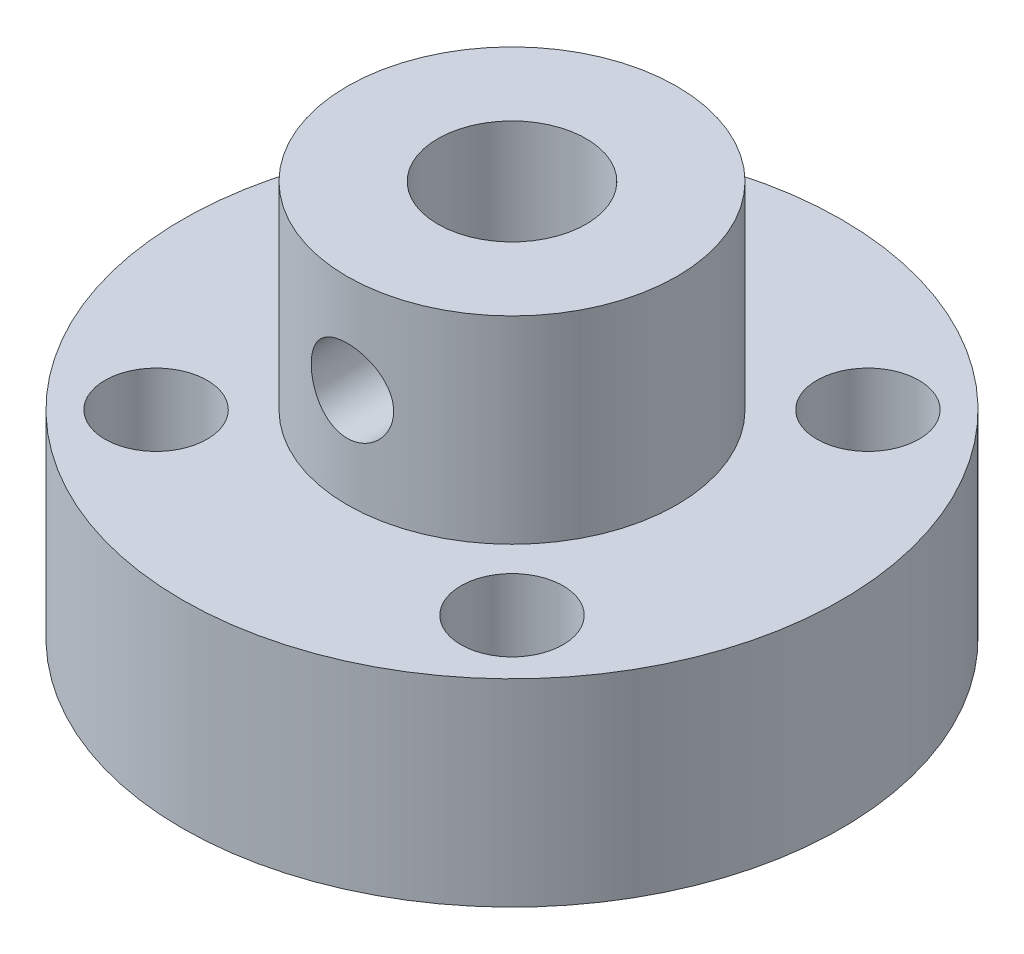
ISO-10303-21;
HEADER;
FILE_DESCRIPTION(('STEP AP214'),'2;1');
FILE_NAME('part.step','',(''),(''),'','','');
FILE_SCHEMA(('AUTOMOTIVE_DESIGN { 1 0 10303 214 1 1 1 1 }'));
ENDSEC;
DATA;
#1=APPLICATION_CONTEXT('core data for automotive mechanical design processes');
#2=APPLICATION_PROTOCOL_DEFINITION('international standard','automotive_design',2000,#1);
#3=PRODUCT_CONTEXT('',#1,'mechanical');
#4=PRODUCT('Part','Part','',(#3));
#5=PRODUCT_RELATED_PRODUCT_CATEGORY('part','',(#4));
#6=PRODUCT_DEFINITION_FORMATION('','',#4);
#7=PRODUCT_DEFINITION_CONTEXT('part definition',#1,'design');
#8=PRODUCT_DEFINITION('design','',#6,#7);
#9=PRODUCT_DEFINITION_SHAPE('','',#8);
#10=(LENGTH_UNIT() NAMED_UNIT(*) SI_UNIT(.MILLI.,.METRE.));
#11=(NAMED_UNIT(*) PLANE_ANGLE_UNIT() SI_UNIT($,.RADIAN.));
#12=(NAMED_UNIT(*) SI_UNIT($,.STERADIAN.) SOLID_ANGLE_UNIT());
#13=UNCERTAINTY_MEASURE_WITH_UNIT(LENGTH_MEASURE(1.E-05),#10,'distance_accuracy_value','');
#14=(GEOMETRIC_REPRESENTATION_CONTEXT(3) GLOBAL_UNCERTAINTY_ASSIGNED_CONTEXT((#13)) GLOBAL_UNIT_ASSIGNED_CONTEXT((#10,
#11,#12)) REPRESENTATION_CONTEXT('',''));
#15=CARTESIAN_POINT('',(0.,0.,0.));
#16=DIRECTION('',(0.,0.,1.));
#17=DIRECTION('',(1.,0.,0.));
#18=AXIS2_PLACEMENT_3D('',#15,#16,#17);
#19=CARTESIAN_POINT('',(0.,6.,0.));
#20=DIRECTION('',(0.,-1.,0.));
#21=DIRECTION('',(0.,0.,-1.));
#22=AXIS2_PLACEMENT_3D('',#19,#20,#21);
#23=CYLINDRICAL_SURFACE('',#22,10.);
#24=CARTESIAN_POINT('',(0.,6.,0.));
#25=DIRECTION('',(0.,1.,0.));
#26=DIRECTION('',(0.,0.,1.));
#27=AXIS2_PLACEMENT_3D('',#24,#25,#26);
#28=CIRCLE('',#27,10.);
#29=CARTESIAN_POINT('',(0.,6.,10.));
#30=VERTEX_POINT('',#29);
#31=EDGE_CURVE('E10',#30,#30,#28,.T.);
#32=ORIENTED_EDGE('',*,*,#31,.F.);
#33=EDGE_LOOP('',(#32));
#34=FACE_BOUND('',#33,.T.);
#35=CARTESIAN_POINT('',(0.,0.,0.));
#36=DIRECTION('',(0.,1.,0.));
#37=DIRECTION('',(0.,0.,1.));
#38=AXIS2_PLACEMENT_3D('',#35,#36,#37);
#39=CIRCLE('',#38,10.);
#40=CARTESIAN_POINT('',(0.,0.,10.));
#41=VERTEX_POINT('',#40);
#42=EDGE_CURVE('E40',#41,#41,#39,.T.);
#43=ORIENTED_EDGE('',*,*,#42,.T.);
#44=EDGE_LOOP('',(#43));
#45=FACE_BOUND('',#44,.T.);
#46=ADVANCED_FACE('F37',(#34,#45),#23,.T.);
#47=CARTESIAN_POINT('',(0.,6.,0.));
#48=DIRECTION('',(0.,1.,0.));
#49=DIRECTION('',(0.,0.,1.));
#50=AXIS2_PLACEMENT_3D('',#47,#48,#49);
#51=PLANE('',#50);
#52=CARTESIAN_POINT('',(5.4,6.,-5.4));
#53=DIRECTION('',(0.,1.,0.));
#54=DIRECTION('',(0.,0.,1.));
#55=AXIS2_PLACEMENT_3D('',#52,#53,#54);
#56=CIRCLE('',#55,1.55);
#57=CARTESIAN_POINT('',(5.4,6.,-3.85));
#58=VERTEX_POINT('',#57);
#59=EDGE_CURVE('E80',#58,#58,#56,.T.);
#60=ORIENTED_EDGE('',*,*,#59,.F.);
#61=EDGE_LOOP('',(#60));
#62=FACE_BOUND('',#61,.T.);
#63=CARTESIAN_POINT('',(5.4,6.,5.4));
#64=DIRECTION('',(0.,1.,0.));
#65=DIRECTION('',(0.,0.,1.));
#66=AXIS2_PLACEMENT_3D('',#63,#64,#65);
#67=CIRCLE('',#66,1.55);
#68=CARTESIAN_POINT('',(5.4,6.,6.95));
#69=VERTEX_POINT('',#68);
#70=EDGE_CURVE('E74',#69,#69,#67,.T.);
#71=ORIENTED_EDGE('',*,*,#70,.F.);
#72=EDGE_LOOP('',(#71));
#73=FACE_BOUND('',#72,.T.);
#74=CARTESIAN_POINT('',(-5.4,6.,5.4));
#75=DIRECTION('',(0.,1.,0.));
#76=DIRECTION('',(0.,0.,1.));
#77=AXIS2_PLACEMENT_3D('',#74,#75,#76);
#78=CIRCLE('',#77,1.55);
#79=CARTESIAN_POINT('',(-5.4,6.,6.95));
#80=VERTEX_POINT('',#79);
#81=EDGE_CURVE('E67',#80,#80,#78,.T.);
#82=ORIENTED_EDGE('',*,*,#81,.F.);
#83=EDGE_LOOP('',(#82));
#84=FACE_BOUND('',#83,.T.);
#85=CARTESIAN_POINT('',(-5.4,6.,-5.4));
#86=DIRECTION('',(0.,1.,0.));
#87=DIRECTION('',(0.,0.,1.));
#88=AXIS2_PLACEMENT_3D('',#85,#86,#87);
#89=CIRCLE('',#88,1.55);
#90=CARTESIAN_POINT('',(-5.4,6.,-3.85));
#91=VERTEX_POINT('',#90);
#92=EDGE_CURVE('E61',#91,#91,#89,.T.);
#93=ORIENTED_EDGE('',*,*,#92,.F.);
#94=EDGE_LOOP('',(#93));
#95=FACE_BOUND('',#94,.T.);
#96=CARTESIAN_POINT('',(0.,6.,0.));
#97=DIRECTION('',(0.,1.,0.));
#98=DIRECTION('',(0.,0.,1.));
#99=AXIS2_PLACEMENT_3D('',#96,#97,#98);
#100=CIRCLE('',#99,5.);
#101=CARTESIAN_POINT('',(0.,6.,5.));
#102=VERTEX_POINT('',#101);
#103=EDGE_CURVE('E49',#102,#102,#100,.T.);
#104=ORIENTED_EDGE('',*,*,#103,.F.);
#105=EDGE_LOOP('',(#104));
#106=FACE_BOUND('',#105,.T.);
#107=ORIENTED_EDGE('',*,*,#31,.T.);
#108=EDGE_LOOP('',(#107));
#109=FACE_BOUND('',#108,.T.);
#110=ADVANCED_FACE('F132',(#62,#73,#84,#95,#106,#109),#51,.T.);
#111=CARTESIAN_POINT('',(0.,0.,0.));
#112=DIRECTION('',(0.,1.,0.));
#113=DIRECTION('',(0.,0.,1.));
#114=AXIS2_PLACEMENT_3D('',#111,#112,#113);
#115=PLANE('',#114);
#116=CARTESIAN_POINT('',(5.4,0.,-5.4));
#117=DIRECTION('',(0.,1.,0.));
#118=DIRECTION('',(0.,0.,1.));
#119=AXIS2_PLACEMENT_3D('',#116,#117,#118);
#120=CIRCLE('',#119,1.55);
#121=CARTESIAN_POINT('',(5.4,0.,-3.85));
#122=VERTEX_POINT('',#121);
#123=EDGE_CURVE('E64',#122,#122,#120,.T.);
#124=ORIENTED_EDGE('',*,*,#123,.T.);
#125=EDGE_LOOP('',(#124));
#126=FACE_BOUND('',#125,.T.);
#127=CARTESIAN_POINT('',(5.4,0.,5.4));
#128=DIRECTION('',(0.,1.,0.));
#129=DIRECTION('',(0.,0.,1.));
#130=AXIS2_PLACEMENT_3D('',#127,#128,#129);
#131=CIRCLE('',#130,1.55);
#132=CARTESIAN_POINT('',(5.4,0.,6.95));
#133=VERTEX_POINT('',#132);
#134=EDGE_CURVE('E77',#133,#133,#131,.T.);
#135=ORIENTED_EDGE('',*,*,#134,.T.);
#136=EDGE_LOOP('',(#135));
#137=FACE_BOUND('',#136,.T.);
#138=CARTESIAN_POINT('',(-5.4,0.,5.4));
#139=DIRECTION('',(0.,1.,0.));
#140=DIRECTION('',(0.,0.,1.));
#141=AXIS2_PLACEMENT_3D('',#138,#139,#140);
#142=CIRCLE('',#141,1.55);
#143=CARTESIAN_POINT('',(-5.4,0.,6.95));
#144=VERTEX_POINT('',#143);
#145=EDGE_CURVE('E70',#144,#144,#142,.T.);
#146=ORIENTED_EDGE('',*,*,#145,.T.);
#147=EDGE_LOOP('',(#146));
#148=FACE_BOUND('',#147,.T.);
#149=CARTESIAN_POINT('',(-5.4,0.,-5.4));
#150=DIRECTION('',(0.,1.,0.));
#151=DIRECTION('',(0.,0.,1.));
#152=AXIS2_PLACEMENT_3D('',#149,#150,#151);
#153=CIRCLE('',#152,1.55);
#154=CARTESIAN_POINT('',(-5.4,0.,-3.85));
#155=VERTEX_POINT('',#154);
#156=EDGE_CURVE('E58',#155,#155,#153,.T.);
#157=ORIENTED_EDGE('',*,*,#156,.T.);
#158=EDGE_LOOP('',(#157));
#159=FACE_BOUND('',#158,.T.);
#160=ORIENTED_EDGE('',*,*,#42,.F.);
#161=EDGE_LOOP('',(#160));
#162=FACE_BOUND('',#161,.T.);
#163=ADVANCED_FACE('F130',(#126,#137,#148,#159,#162),#115,.F.);
#164=CARTESIAN_POINT('',(0.,12.,0.));
#165=DIRECTION('',(0.,-1.,0.));
#166=DIRECTION('',(0.,0.,-1.));
#167=AXIS2_PLACEMENT_3D('',#164,#165,#166);
#168=CYLINDRICAL_SURFACE('',#167,5.);
#169=CARTESIAN_POINT('',(1.25,9.,4.84122918275927));
#170=CARTESIAN_POINT('',(1.24999803929589,9.06902537546231,4.84123050042654));
#171=CARTESIAN_POINT('',(1.24426312274865,9.138072449339,4.84272153006957));
#172=CARTESIAN_POINT('',(1.22151156273207,9.27418378908702,4.84850930996624));
#173=CARTESIAN_POINT('',(1.2044883533711,9.34124687723416,4.85280769310907));
#174=CARTESIAN_POINT('',(1.15974559981597,9.47140176909352,4.86369362297984));
#175=CARTESIAN_POINT('',(1.13203986392723,9.53449857769284,4.87027821345204));
#176=CARTESIAN_POINT('',(1.06676057063071,9.65515542626996,4.88499096014404));
#177=CARTESIAN_POINT('',(1.02918659428035,9.71271523104011,4.89311918189251));
#178=CARTESIAN_POINT('',(0.944354213655938,9.8219308226311,4.91020358177806));
#179=CARTESIAN_POINT('',(0.896918443852026,9.87344680017502,4.91917298811515));
#180=CARTESIAN_POINT('',(0.794091032050333,9.96788069718017,4.93681437757649));
#181=CARTESIAN_POINT('',(0.738698647090154,10.0107978128109,4.94548633283195));
#182=CARTESIAN_POINT('',(0.620572600539477,10.0873877338156,4.96170207760291));
#183=CARTESIAN_POINT('',(0.55774728809756,10.1209231940807,4.96922843700296));
#184=CARTESIAN_POINT('',(0.427131592146381,10.1769048220765,4.98215405962992));
#185=CARTESIAN_POINT('',(0.35934194289597,10.1993526259578,4.98755363667172));
#186=CARTESIAN_POINT('',(0.222179379377081,10.2320739172893,4.9955237942409));
#187=CARTESIAN_POINT('',(0.152866359774488,10.2425848221633,4.99814946922157));
#188=CARTESIAN_POINT('',(0.013414409631385,10.2518791896378,5.00046797053649));
#189=CARTESIAN_POINT('',(-0.0567243972690338,10.2506643861048,5.00016123048352));
#190=CARTESIAN_POINT('',(-0.194190308965484,10.2367125748749,4.99669047476767));
#191=CARTESIAN_POINT('',(-0.261545269501333,10.2242318374731,4.99359001170437));
#192=CARTESIAN_POINT('',(-0.393172809267107,10.1885143649758,4.98495418262427));
#193=CARTESIAN_POINT('',(-0.457445224213047,10.1652770573113,4.9794186869922));
#194=CARTESIAN_POINT('',(-0.581758379377257,10.1084987146565,4.96643754850448));
#195=CARTESIAN_POINT('',(-0.64175563720813,10.0748664776691,4.95897509847527));
#196=CARTESIAN_POINT('',(-0.75534452792561,9.99832216044187,4.94294951904825));
#197=CARTESIAN_POINT('',(-0.808935043856881,9.95540846571969,4.93438619826245));
#198=CARTESIAN_POINT('',(-0.909717543856194,9.86014562900881,4.9168185688476));
#199=CARTESIAN_POINT('',(-0.956697098843999,9.80757255382611,4.90780859762959));
#200=CARTESIAN_POINT('',(-1.04122046995377,9.69520001322988,4.89057521758353));
#201=CARTESIAN_POINT('',(-1.07876384505752,9.6354002102545,4.88235184552985));
#202=CARTESIAN_POINT('',(-1.14348516127825,9.50985498292552,4.86760248415824));
#203=CARTESIAN_POINT('',(-1.17061195871311,9.4440821348434,4.8610849186286));
#204=CARTESIAN_POINT('',(-1.21335702579543,9.30870726596177,4.85059320069978));
#205=CARTESIAN_POINT('',(-1.22897775819114,9.23910606800843,4.84661850405109));
#206=CARTESIAN_POINT('',(-1.24791481933259,9.10002024923844,4.8417767801957));
#207=CARTESIAN_POINT('',(-1.25154523695981,9.03058110333519,4.84083044546824));
#208=CARTESIAN_POINT('',(-1.24725849525777,8.89208903171092,4.8419367174052));
#209=CARTESIAN_POINT('',(-1.2393423989244,8.82303607102438,4.84398904800633));
#210=CARTESIAN_POINT('',(-1.21246273196883,8.68844286752265,4.8507854097728));
#211=CARTESIAN_POINT('',(-1.19368203414087,8.62286363671458,4.85548485117188));
#212=CARTESIAN_POINT('',(-1.14580904083531,8.49578427107416,4.86700359135481));
#213=CARTESIAN_POINT('',(-1.11671552385627,8.43428462047233,4.87382314124307));
#214=CARTESIAN_POINT('',(-1.04838533396828,8.31577936106633,4.88898068546631));
#215=CARTESIAN_POINT('',(-1.00896087691781,8.25888557997845,4.89734584303321));
#216=CARTESIAN_POINT('',(-0.921325366168069,8.15240581859933,4.91458541535858));
#217=CARTESIAN_POINT('',(-0.873112868506799,8.10282104167496,4.92345991364235));
#218=CARTESIAN_POINT('',(-0.767828401230907,8.01109447871452,4.94098701515803));
#219=CARTESIAN_POINT('',(-0.710564940664491,7.96916996872559,4.94962851030918));
#220=CARTESIAN_POINT('',(-0.589628353368345,7.89553206652438,4.96548608306867));
#221=CARTESIAN_POINT('',(-0.525955561196989,7.8638181416959,4.9727022350198));
#222=CARTESIAN_POINT('',(-0.394447752163863,7.81177698273604,4.98485057869157));
#223=CARTESIAN_POINT('',(-0.326646726284852,7.79136785781047,4.98979915011205));
#224=CARTESIAN_POINT('',(-0.18843720039851,7.76226983269579,4.99692646697894));
#225=CARTESIAN_POINT('',(-0.118029206301555,7.75357867063048,4.99910574696704));
#226=CARTESIAN_POINT('',(0.0213544080541578,7.74829051303058,5.00042711761014));
#227=CARTESIAN_POINT('',(0.0903172837075413,7.75137286363076,4.9996497360001));
#228=CARTESIAN_POINT('',(0.226709370518424,7.76880978411792,4.9953237057178));
#229=CARTESIAN_POINT('',(0.294138627226108,7.78316401876638,4.99177513946369));
#230=CARTESIAN_POINT('',(0.42521379455602,7.82256527471366,4.98231791067453));
#231=CARTESIAN_POINT('',(0.488878118226273,7.84755431664328,4.97642205628333));
#232=CARTESIAN_POINT('',(0.611146316301835,7.90746322377416,4.9628911114173));
#233=CARTESIAN_POINT('',(0.669749551581314,7.94238434083696,4.9552558017217));
#234=CARTESIAN_POINT('',(0.781752410529873,8.02214404249634,4.93884062101666));
#235=CARTESIAN_POINT('',(0.83499373537573,8.06720017863422,4.93003771182014));
#236=CARTESIAN_POINT('',(0.933268775339069,8.16552856496725,4.91238311316553));
#237=CARTESIAN_POINT('',(0.978300406335237,8.21880289512238,4.90353141190695));
#238=CARTESIAN_POINT('',(1.05970253309904,8.33325176775167,4.88659344825685));
#239=CARTESIAN_POINT('',(1.09589577430819,8.39455515426579,4.87852454662356));
#240=CARTESIAN_POINT('',(1.15740862076958,8.52256936240338,4.8642994443827));
#241=CARTESIAN_POINT('',(1.18273613719965,8.58927620763343,4.85814185308378));
#242=CARTESIAN_POINT('',(1.2180281607068,8.7132212647834,4.84939885924729));
#243=CARTESIAN_POINT('',(1.22999146324422,8.76986645547983,4.84635828750683));
#244=CARTESIAN_POINT('',(1.24597786571659,8.88433608624996,4.84227298231965));
#245=CARTESIAN_POINT('',(1.25000164296523,8.94216042530633,4.84122807862454));
#246=CARTESIAN_POINT('',(1.25,9.,4.84122918275927));
#247=B_SPLINE_CURVE_WITH_KNOTS('',3,(#169,#170,#171,#172,#173,#174,#175,#176,#177,#178,#179,
#180,#181,#182,#183,#184,#185,#186,#187,#188,#189,#190,#191,#192,#193,#194,#195,#196,#197,#198,
#199,#200,#201,#202,#203,#204,#205,#206,#207,#208,#209,#210,#211,#212,#213,#214,#215,#216,#217,
#218,#219,#220,#221,#222,#223,#224,#225,#226,#227,#228,#229,#230,#231,#232,#233,#234,#235,#236,
#237,#238,#239,#240,#241,#242,#243,#244,#245,#246),.UNSPECIFIED.,.T.,.F.,(4,2,2,2,2,2,2,2,2,2,2,
2,2,2,2,2,2,2,2,2,2,2,2,2,2,2,2,2,2,2,2,2,2,2,2,2,2,2,4),(0.,0.206863720868071,
0.413847870714333,0.620565363583008,0.827291633777391,1.03811977096488,1.24896760739933,
1.4627574819896,1.67651579923546,1.88594375497673,2.0953407433301,2.30009131344474,
2.50485278362393,2.71146437127222,2.91811192734457,3.13035233285956,3.34260265599901,
3.55588216004201,3.76911600064774,3.97671787380859,4.18430063591901,4.38848702504604,
4.59269760710709,4.80091422929579,5.00916509442522,5.22262665482659,5.43607707859777,
5.64796036403465,5.85980274454519,6.06591723063728,6.27202558688491,6.47702438279855,
6.68204902869036,6.89198548291035,7.10197515782754,7.31588238642338,7.5296336068331,
7.70298913588665,7.8763298754976),.UNSPECIFIED.);
#248=CARTESIAN_POINT('',(1.25,9.,4.84122918275927));
#249=VERTEX_POINT('',#248);
#250=EDGE_CURVE('E71',#249,#249,#247,.T.);
#251=ORIENTED_EDGE('',*,*,#250,.F.);
#252=EDGE_LOOP('',(#251));
#253=FACE_BOUND('',#252,.T.);
#254=CARTESIAN_POINT('',(0.,12.,0.));
#255=DIRECTION('',(0.,1.,0.));
#256=DIRECTION('',(0.,0.,1.));
#257=AXIS2_PLACEMENT_3D('',#254,#255,#256);
#258=CIRCLE('',#257,5.);
#259=CARTESIAN_POINT('',(0.,12.,5.));
#260=VERTEX_POINT('',#259);
#261=EDGE_CURVE('E47',#260,#260,#258,.T.);
#262=ORIENTED_EDGE('',*,*,#261,.F.);
#263=EDGE_LOOP('',(#262));
#264=FACE_BOUND('',#263,.T.);
#265=ORIENTED_EDGE('',*,*,#103,.T.);
#266=EDGE_LOOP('',(#265));
#267=FACE_BOUND('',#266,.T.);
#268=ADVANCED_FACE('F126',(#253,#264,#267),#168,.T.);
#269=CARTESIAN_POINT('',(0.,12.,0.));
#270=DIRECTION('',(0.,1.,0.));
#271=DIRECTION('',(0.,0.,1.));
#272=AXIS2_PLACEMENT_3D('',#269,#270,#271);
#273=PLANE('',#272);
#274=CARTESIAN_POINT('',(0.,12.,0.));
#275=DIRECTION('',(0.,1.,0.));
#276=DIRECTION('',(0.,0.,1.));
#277=AXIS2_PLACEMENT_3D('',#274,#275,#276);
#278=CIRCLE('',#277,2.25);
#279=CARTESIAN_POINT('',(0.,12.,2.25));
#280=VERTEX_POINT('',#279);
#281=EDGE_CURVE('E55',#280,#280,#278,.T.);
#282=ORIENTED_EDGE('',*,*,#281,.F.);
#283=EDGE_LOOP('',(#282));
#284=FACE_BOUND('',#283,.T.);
#285=ORIENTED_EDGE('',*,*,#261,.T.);
#286=EDGE_LOOP('',(#285));
#287=FACE_BOUND('',#286,.T.);
#288=ADVANCED_FACE('F122',(#284,#287),#273,.T.);
#289=CARTESIAN_POINT('',(0.,3.,0.));
#290=DIRECTION('',(0.,1.,0.));
#291=DIRECTION('',(0.,0.,1.));
#292=AXIS2_PLACEMENT_3D('',#289,#290,#291);
#293=CYLINDRICAL_SURFACE('',#292,2.25);
#294=CARTESIAN_POINT('',(1.25,9.,1.87082869338697));
#295=CARTESIAN_POINT('',(1.24999519169269,8.93606441188263,1.87083547491036));
#296=CARTESIAN_POINT('',(1.24506045977123,8.87207601242481,1.87415829198376));
#297=CARTESIAN_POINT('',(1.22561894194091,8.74616052355392,1.88692443270436));
#298=CARTESIAN_POINT('',(1.21109641926997,8.68423699912171,1.89637781820616));
#299=CARTESIAN_POINT('',(1.17336265347683,8.56452731616227,1.919949607162));
#300=CARTESIAN_POINT('',(1.15020658560427,8.5067176030019,1.9340383213412));
#301=CARTESIAN_POINT('',(1.09603287771773,8.39582703320304,1.96524472459966));
#302=CARTESIAN_POINT('',(1.06501349152892,8.34274723045941,1.9823630862051));
#303=CARTESIAN_POINT('',(0.99224923589666,8.236791631884,2.01984701225051));
#304=CARTESIAN_POINT('',(0.949727471196916,8.18450320821001,2.04036534745121));
#305=CARTESIAN_POINT('',(0.856768754177862,8.08732683755131,2.08111149864697));
#306=CARTESIAN_POINT('',(0.806326991343237,8.0424434224849,2.10133912986775));
#307=CARTESIAN_POINT('',(0.693549261846738,7.9574550828609,2.14134820280897));
#308=CARTESIAN_POINT('',(0.630556848402873,7.91811983479057,2.1609332338589));
#309=CARTESIAN_POINT('',(0.497554215426932,7.85087916866997,2.19536857495267));
#310=CARTESIAN_POINT('',(0.42754950484735,7.82296486449332,2.21022256400774));
#311=CARTESIAN_POINT('',(0.288771227369758,7.78184715543885,2.23240311443292));
#312=CARTESIAN_POINT('',(0.220393795730234,7.76759969706,2.24025983166457));
#313=CARTESIAN_POINT('',(0.0818084699985884,7.75073275759826,2.24958134718211));
#314=CARTESIAN_POINT('',(0.0116020409930012,7.74810424097574,2.25105111230448));
#315=CARTESIAN_POINT('',(-0.120589453713138,7.75426174331442,2.24763476462082));
#316=CARTESIAN_POINT('',(-0.182651917097131,7.76185890765348,2.24341056354245));
#317=CARTESIAN_POINT('',(-0.304453242084884,7.78605451883324,2.23014826184179));
#318=CARTESIAN_POINT('',(-0.364191924196203,7.80265365952667,2.22110979014695));
#319=CARTESIAN_POINT('',(-0.48048980468142,7.84436668797408,2.19890301907778));
#320=CARTESIAN_POINT('',(-0.537009868854531,7.86956660526492,2.18569309859594));
#321=CARTESIAN_POINT('',(-0.645125381432435,7.92758154939479,2.15625994732955));
#322=CARTESIAN_POINT('',(-0.696719275736395,7.96039896826237,2.14003577033588));
#323=CARTESIAN_POINT('',(-0.799547764439904,8.03679572920391,2.10392659648003));
#324=CARTESIAN_POINT('',(-0.850127402186653,8.08115908646278,2.08383530071291));
#325=CARTESIAN_POINT('',(-0.943519119322965,8.1773380660711,2.04324988994665));
#326=CARTESIAN_POINT('',(-0.986322877334296,8.22916156687926,2.02275536911894));
#327=CARTESIAN_POINT('',(-1.06682998962204,8.34444428639223,1.98156460956708));
#328=CARTESIAN_POINT('',(-1.10371826342479,8.40853259981356,1.96101876843387));
#329=CARTESIAN_POINT('',(-1.16595018599611,8.54332372512622,1.92467359228525));
#330=CARTESIAN_POINT('',(-1.1913072110987,8.61401875777285,1.908868764943));
#331=CARTESIAN_POINT('',(-1.22755140512998,8.75418957750236,1.88574911218536));
#332=CARTESIAN_POINT('',(-1.23943863022233,8.82330582990811,1.87785351692605));
#333=CARTESIAN_POINT('',(-1.25140876683761,8.96296705888795,1.86990304147774));
#334=CARTESIAN_POINT('',(-1.25150595222897,9.03351020442119,1.86983868023437));
#335=CARTESIAN_POINT('',(-1.24080754542958,9.16265038607813,1.87694383276645));
#336=CARTESIAN_POINT('',(-1.23164098011776,9.22145440679951,1.88303150854594));
#337=CARTESIAN_POINT('',(-1.20529678937005,9.33651898745873,1.90000091369737));
#338=CARTESIAN_POINT('',(-1.18811550365507,9.39277837238417,1.91088483336194));
#339=CARTESIAN_POINT('',(-1.14555544977081,9.50387426597027,1.9367092876972));
#340=CARTESIAN_POINT('',(-1.11986778905297,9.55855636873551,1.95179862941533));
#341=CARTESIAN_POINT('',(-1.06127968066909,9.66316197812389,1.98426485020479));
#342=CARTESIAN_POINT('',(-1.02837571231889,9.71308314486932,2.00164284420219));
#343=CARTESIAN_POINT('',(-0.950084356331487,9.81524561449341,2.04010647512466));
#344=CARTESIAN_POINT('',(-0.90353764354294,9.86654849390113,2.06133610460365));
#345=CARTESIAN_POINT('',(-0.80235449085882,9.96099959793583,2.10278829725584));
#346=CARTESIAN_POINT('',(-0.747713088874458,10.0041427834302,2.12301023247335));
#347=CARTESIAN_POINT('',(-0.628130216607994,10.0832164945073,2.16150437240574));
#348=CARTESIAN_POINT('',(-0.562792736870108,10.1186340445131,2.17961312986977));
#349=CARTESIAN_POINT('',(-0.425801081943969,10.1775981501848,2.2104531908143));
#350=CARTESIAN_POINT('',(-0.354153667969691,10.20115723488,2.22319016751787));
#351=CARTESIAN_POINT('',(-0.214495054816968,10.2333238915192,2.2407425992894));
#352=CARTESIAN_POINT('',(-0.146866337071754,10.243218713432,2.24623736637027));
#353=CARTESIAN_POINT('',(-0.0106955447517721,10.2518111984794,2.25100337258375));
#354=CARTESIAN_POINT('',(0.0578460056923802,10.2505150320814,2.25027804134466));
#355=CARTESIAN_POINT('',(0.187168728940189,10.2374571938088,2.24305087686886));
#356=CARTESIAN_POINT('',(0.248082865395452,10.2266712019538,2.23708766054341));
#357=CARTESIAN_POINT('',(0.367083582425547,10.1964611183707,2.22066628532642));
#358=CARTESIAN_POINT('',(0.425169831198721,10.1770360156959,2.21020760038091));
#359=CARTESIAN_POINT('',(0.539073859204651,10.1295281498949,2.18527165138135));
#360=CARTESIAN_POINT('',(0.594754416670638,10.1011819199851,2.17067365205665));
#361=CARTESIAN_POINT('',(0.700744552108892,10.0369673791011,2.13881383796261));
#362=CARTESIAN_POINT('',(0.751052001525607,10.0010961036389,2.12155097408127));
#363=CARTESIAN_POINT('',(0.851089282134768,9.91806897576438,2.08358607007981));
#364=CARTESIAN_POINT('',(0.900070048359062,9.87008556538136,2.06271761391765));
#365=CARTESIAN_POINT('',(0.989667425969043,9.76664663259985,2.02126234325229));
#366=CARTESIAN_POINT('',(1.03027353759026,9.71118187272575,2.00067591215123));
#367=CARTESIAN_POINT('',(1.10471929675298,9.58952158758154,1.96061350105322));
#368=CARTESIAN_POINT('',(1.13787771593735,9.52284466724464,1.94131888925855));
#369=CARTESIAN_POINT('',(1.19204732823477,9.38349385204777,1.90854463661867));
#370=CARTESIAN_POINT('',(1.21309677241223,9.31083967934384,1.89504671921607));
#371=CARTESIAN_POINT('',(1.23490202122821,9.19769257322548,1.88084809991533));
#372=CARTESIAN_POINT('',(1.24054888755032,9.15846837491991,1.87711452234935));
#373=CARTESIAN_POINT('',(1.24809927332267,9.0795029079531,1.87210277514529));
#374=CARTESIAN_POINT('',(1.25000299029567,9.03976166668719,1.87082447594437));
#375=CARTESIAN_POINT('',(1.25,9.,1.87082869338697));
#376=B_SPLINE_CURVE_WITH_KNOTS('',3,(#294,#295,#296,#297,#298,#299,#300,#301,#302,#303,#304,
#305,#306,#307,#308,#309,#310,#311,#312,#313,#314,#315,#316,#317,#318,#319,#320,#321,#322,#323,
#324,#325,#326,#327,#328,#329,#330,#331,#332,#333,#334,#335,#336,#337,#338,#339,#340,#341,#342,
#343,#344,#345,#346,#347,#348,#349,#350,#351,#352,#353,#354,#355,#356,#357,#358,#359,#360,#361,
#362,#363,#364,#365,#366,#367,#368,#369,#370,#371,#372,#373,#374,#375),.UNSPECIFIED.,.T.,.F.,(4,
2,2,2,2,2,2,2,2,2,2,2,2,2,2,2,2,2,2,2,2,2,2,2,2,2,2,2,2,2,2,2,2,2,2,2,2,2,2,2,4),(0.,
0.191637691560667,0.383590709082875,0.574337453696023,0.765126593818894,0.975622364810841,
1.18624648664442,1.41543197056625,1.64443879483205,1.85408772164949,2.06357358500922,
2.2506909189369,2.4378226775113,2.62688392293731,2.81600461740532,3.02578513796199,
3.23578884994559,3.46484559777839,3.69363595603063,3.90401854367634,4.11414642451355,
4.29280740714077,4.47155006326622,4.65766536436509,4.84387166998884,5.06029917365196,
5.27685990179509,5.5050726769285,5.73304382568707,5.9375975104829,6.14203841603567,
6.32763479923361,6.51325290659766,6.7049691899948,6.89676114223624,7.11088105765152,
7.32526781654363,7.55480949282742,7.78362203047068,7.90280817335289,8.02198802671641),.UNSPECIFIED.);
#377=CARTESIAN_POINT('',(1.25,9.,1.87082869338697));
#378=VERTEX_POINT('',#377);
#379=EDGE_CURVE('E91',#378,#378,#376,.T.);
#380=ORIENTED_EDGE('',*,*,#379,.F.);
#381=EDGE_LOOP('',(#380));
#382=FACE_BOUND('',#381,.T.);
#383=CARTESIAN_POINT('',(0.,3.,0.));
#384=DIRECTION('',(0.,1.,0.));
#385=DIRECTION('',(0.,0.,1.));
#386=AXIS2_PLACEMENT_3D('',#383,#384,#385);
#387=CIRCLE('',#386,2.25);
#388=CARTESIAN_POINT('',(0.,3.,2.25));
#389=VERTEX_POINT('',#388);
#390=EDGE_CURVE('E52',#389,#389,#387,.T.);
#391=ORIENTED_EDGE('',*,*,#390,.F.);
#392=EDGE_LOOP('',(#391));
#393=FACE_BOUND('',#392,.T.);
#394=ORIENTED_EDGE('',*,*,#281,.T.);
#395=EDGE_LOOP('',(#394));
#396=FACE_BOUND('',#395,.T.);
#397=ADVANCED_FACE('F118',(#382,#393,#396),#293,.F.);
#398=CARTESIAN_POINT('',(0.,3.,0.));
#399=DIRECTION('',(0.,1.,0.));
#400=DIRECTION('',(0.,0.,1.));
#401=AXIS2_PLACEMENT_3D('',#398,#399,#400);
#402=PLANE('',#401);
#403=ORIENTED_EDGE('',*,*,#390,.T.);
#404=EDGE_LOOP('',(#403));
#405=FACE_BOUND('',#404,.T.);
#406=ADVANCED_FACE('F114',(#405),#402,.T.);
#407=CARTESIAN_POINT('',(-5.4,0.,-5.4));
#408=DIRECTION('',(0.,1.,0.));
#409=DIRECTION('',(0.,0.,1.));
#410=AXIS2_PLACEMENT_3D('',#407,#408,#409);
#411=CYLINDRICAL_SURFACE('',#410,1.55);
#412=ORIENTED_EDGE('',*,*,#156,.F.);
#413=EDGE_LOOP('',(#412));
#414=FACE_BOUND('',#413,.T.);
#415=ORIENTED_EDGE('',*,*,#92,.T.);
#416=EDGE_LOOP('',(#415));
#417=FACE_BOUND('',#416,.T.);
#418=ADVANCED_FACE('F110',(#414,#417),#411,.F.);
#419=CARTESIAN_POINT('',(-5.4,0.,5.4));
#420=DIRECTION('',(0.,1.,0.));
#421=DIRECTION('',(0.,0.,1.));
#422=AXIS2_PLACEMENT_3D('',#419,#420,#421);
#423=CYLINDRICAL_SURFACE('',#422,1.55);
#424=ORIENTED_EDGE('',*,*,#145,.F.);
#425=EDGE_LOOP('',(#424));
#426=FACE_BOUND('',#425,.T.);
#427=ORIENTED_EDGE('',*,*,#81,.T.);
#428=EDGE_LOOP('',(#427));
#429=FACE_BOUND('',#428,.T.);
#430=ADVANCED_FACE('F106',(#426,#429),#423,.F.);
#431=CARTESIAN_POINT('',(5.4,0.,5.4));
#432=DIRECTION('',(0.,1.,0.));
#433=DIRECTION('',(0.,0.,1.));
#434=AXIS2_PLACEMENT_3D('',#431,#432,#433);
#435=CYLINDRICAL_SURFACE('',#434,1.55);
#436=ORIENTED_EDGE('',*,*,#134,.F.);
#437=EDGE_LOOP('',(#436));
#438=FACE_BOUND('',#437,.T.);
#439=ORIENTED_EDGE('',*,*,#70,.T.);
#440=EDGE_LOOP('',(#439));
#441=FACE_BOUND('',#440,.T.);
#442=ADVANCED_FACE('F102',(#438,#441),#435,.F.);
#443=CARTESIAN_POINT('',(5.4,0.,-5.4));
#444=DIRECTION('',(0.,1.,0.));
#445=DIRECTION('',(0.,0.,1.));
#446=AXIS2_PLACEMENT_3D('',#443,#444,#445);
#447=CYLINDRICAL_SURFACE('',#446,1.55);
#448=ORIENTED_EDGE('',*,*,#123,.F.);
#449=EDGE_LOOP('',(#448));
#450=FACE_BOUND('',#449,.T.);
#451=ORIENTED_EDGE('',*,*,#59,.T.);
#452=EDGE_LOOP('',(#451));
#453=FACE_BOUND('',#452,.T.);
#454=ADVANCED_FACE('F99',(#450,#453),#447,.F.);
#455=CARTESIAN_POINT('',(0.,9.,-10.001));
#456=DIRECTION('',(0.,0.,1.));
#457=DIRECTION('',(1.,0.,0.));
#458=AXIS2_PLACEMENT_3D('',#455,#456,#457);
#459=CYLINDRICAL_SURFACE('',#458,1.25);
#460=ORIENTED_EDGE('',*,*,#379,.T.);
#461=EDGE_LOOP('',(#460));
#462=FACE_BOUND('',#461,.T.);
#463=ORIENTED_EDGE('',*,*,#250,.T.);
#464=EDGE_LOOP('',(#463));
#465=FACE_BOUND('',#464,.T.);
#466=ADVANCED_FACE('F95',(#462,#465),#459,.F.);
#467=CLOSED_SHELL('',(#46,#110,#163,#268,#288,#397,#406,#418,#430,#442,#454,#466));
#468=MANIFOLD_SOLID_BREP('B2',#467);
#469=ADVANCED_BREP_SHAPE_REPRESENTATION('',(#18,#468),#14);
#470=SHAPE_DEFINITION_REPRESENTATION(#9,#469);
ENDSEC;
END-ISO-10303-21;
